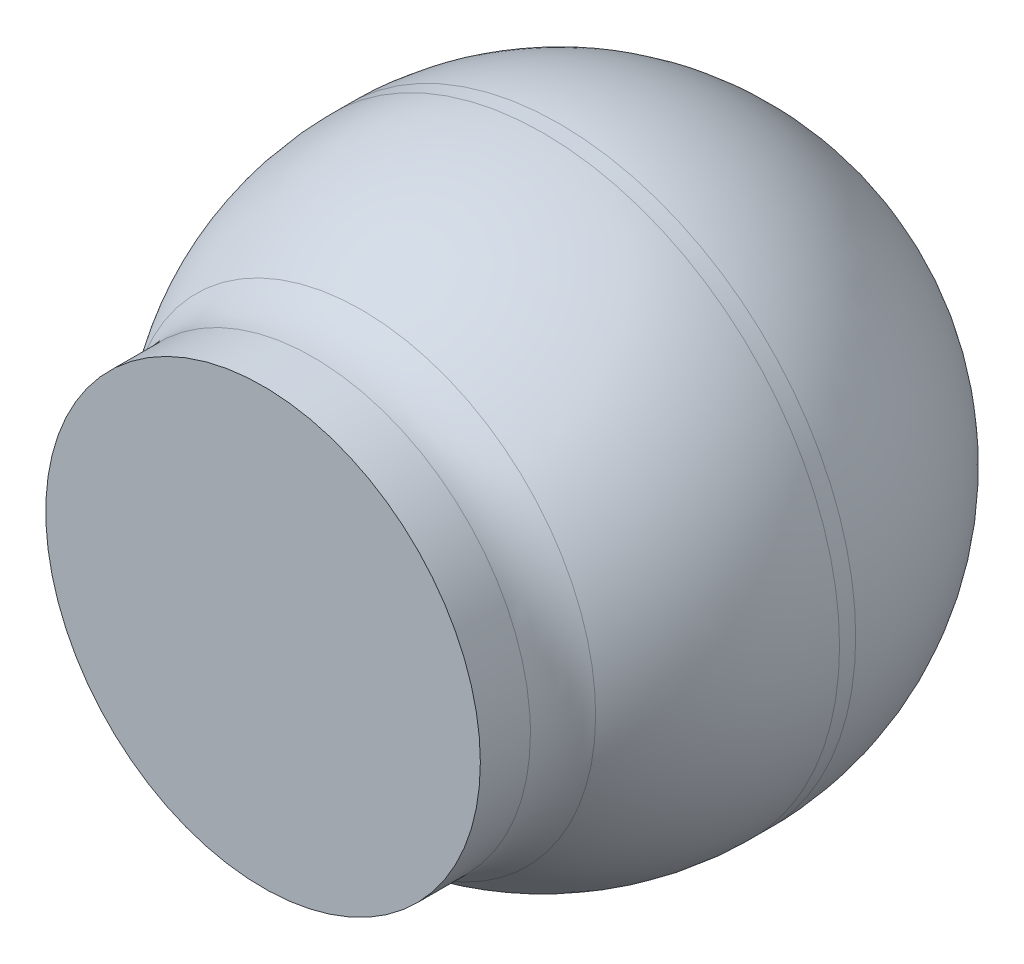
ISO-10303-21;
HEADER;
FILE_DESCRIPTION(('STEP AP214'),'2;1');
FILE_NAME('part.step','',(''),(''),'','','');
FILE_SCHEMA(('AUTOMOTIVE_DESIGN { 1 0 10303 214 1 1 1 1 }'));
ENDSEC;
DATA;
#1=APPLICATION_CONTEXT('core data for automotive mechanical design processes');
#2=APPLICATION_PROTOCOL_DEFINITION('international standard','automotive_design',2000,#1);
#3=PRODUCT_CONTEXT('',#1,'mechanical');
#4=PRODUCT('Part','Part','',(#3));
#5=PRODUCT_RELATED_PRODUCT_CATEGORY('part','',(#4));
#6=PRODUCT_DEFINITION_FORMATION('','',#4);
#7=PRODUCT_DEFINITION_CONTEXT('part definition',#1,'design');
#8=PRODUCT_DEFINITION('design','',#6,#7);
#9=PRODUCT_DEFINITION_SHAPE('','',#8);
#10=(LENGTH_UNIT() NAMED_UNIT(*) SI_UNIT(.MILLI.,.METRE.));
#11=(NAMED_UNIT(*) PLANE_ANGLE_UNIT() SI_UNIT($,.RADIAN.));
#12=(NAMED_UNIT(*) SI_UNIT($,.STERADIAN.) SOLID_ANGLE_UNIT());
#13=UNCERTAINTY_MEASURE_WITH_UNIT(LENGTH_MEASURE(1.E-05),#10,'distance_accuracy_value','');
#14=(GEOMETRIC_REPRESENTATION_CONTEXT(3) GLOBAL_UNCERTAINTY_ASSIGNED_CONTEXT((#13)) GLOBAL_UNIT_ASSIGNED_CONTEXT((#10,
#11,#12)) REPRESENTATION_CONTEXT('',''));
#15=CARTESIAN_POINT('',(0.,0.,0.));
#16=DIRECTION('',(0.,0.,1.));
#17=DIRECTION('',(1.,0.,0.));
#18=AXIS2_PLACEMENT_3D('',#15,#16,#17);
#19=CARTESIAN_POINT('',(-5.642919922269,-4.051349291452,10.006534503384));
#20=DIRECTION('',(0.,0.,-1.));
#21=DIRECTION('',(-1.,0.,0.));
#22=AXIS2_PLACEMENT_3D('',#19,#20,#21);
#23=PLANE('',#22);
#24=CARTESIAN_POINT('',(-5.642919922269,-4.051349291452,10.006534503384));
#25=DIRECTION('',(0.,0.,1.));
#26=DIRECTION('',(1.,0.,0.));
#27=AXIS2_PLACEMENT_3D('',#24,#25,#26);
#28=CIRCLE('',#27,0.275);
#29=CARTESIAN_POINT('',(-5.367919922269,-4.051349291452,10.006534503384));
#30=VERTEX_POINT('',#29);
#31=EDGE_CURVE('E20',#30,#30,#28,.F.);
#32=ORIENTED_EDGE('',*,*,#31,.F.);
#33=EDGE_LOOP('',(#32));
#34=FACE_BOUND('',#33,.T.);
#35=ADVANCED_FACE('F17',(#34),#23,.F.);
#36=CARTESIAN_POINT('',(-5.642919922269,-4.051349291452,9.906534503384));
#37=DIRECTION('',(0.,0.,1.));
#38=DIRECTION('',(1.,0.,0.));
#39=AXIS2_PLACEMENT_3D('',#36,#37,#38);
#40=CYLINDRICAL_SURFACE('',#39,0.275);
#41=CARTESIAN_POINT('',(-5.642919922269,-4.051349291452,9.943180457728));
#42=DIRECTION('',(0.,0.,-1.));
#43=DIRECTION('',(0.996700902337583,0.0811622527992439,0.));
#44=AXIS2_PLACEMENT_3D('',#41,#42,#43);
#45=CIRCLE('',#44,0.275);
#46=CARTESIAN_POINT('',(-5.36882717412616,-4.02902967193221,9.943180457728));
#47=VERTEX_POINT('',#46);
#48=EDGE_CURVE('E65',#47,#47,#45,.F.);
#49=ORIENTED_EDGE('',*,*,#48,.T.);
#50=EDGE_LOOP('',(#49));
#51=FACE_BOUND('',#50,.T.);
#52=ORIENTED_EDGE('',*,*,#31,.T.);
#53=EDGE_LOOP('',(#52));
#54=FACE_BOUND('',#53,.T.);
#55=ADVANCED_FACE('F62',(#51,#54),#40,.T.);
#56=CARTESIAN_POINT('',(-5.642919922269,-4.051349291452,9.943180457728));
#57=DIRECTION('',(0.,0.,-1.));
#58=DIRECTION('',(0.996700902337583,0.0811622527992448,0.));
#59=AXIS2_PLACEMENT_3D('',#56,#57,#58);
#60=TOROIDAL_SURFACE('',#59,0.375,0.1);
#61=ORIENTED_EDGE('',*,*,#48,.F.);
#62=EDGE_LOOP('',(#61));
#63=FACE_BOUND('',#62,.T.);
#64=CARTESIAN_POINT('',(-5.642919922269,-4.051349291452,9.881744931236));
#65=DIRECTION('',(0.,0.,-1.));
#66=DIRECTION('',(-0.996700902337598,-0.0811622527990591,0.));
#67=AXIS2_PLACEMENT_3D('',#64,#65,#66);
#68=CIRCLE('',#67,0.296097046412666);
#69=CARTESIAN_POINT('',(-5.938040115608,-4.075381194786,9.881744931236));
#70=VERTEX_POINT('',#69);
#71=EDGE_CURVE('E39',#70,#70,#68,.T.);
#72=ORIENTED_EDGE('',*,*,#71,.F.);
#73=EDGE_LOOP('',(#72));
#74=FACE_BOUND('',#73,.T.);
#75=ADVANCED_FACE('F57',(#63,#74),#60,.F.);
#76=CARTESIAN_POINT('',(-6.016682760645,-4.081785136252,9.651976062157));
#77=CARTESIAN_POINT('',(-6.016682760645,-4.081785136252,9.701461392103));
#78=CARTESIAN_POINT('',(-6.008526217348,-4.081120941579,9.750947004335));
#79=CARTESIAN_POINT('',(-5.992207085349,-4.079792059952,9.798626332798));
#80=CARTESIAN_POINT('',(-5.968341390838,-4.077848654938,9.842699544317));
#81=CARTESIAN_POINT('',(-5.938040115608,-4.075381194786,9.881744931236));
#82=(BOUNDED_CURVE() B_SPLINE_CURVE(5,(#76,#77,#78,#79,#80,#81),.UNSPECIFIED.,.F.,
.F.) B_SPLINE_CURVE_WITH_KNOTS((6,6),(0.,0.661568582165),
.UNSPECIFIED.) CURVE() GEOMETRIC_REPRESENTATION_ITEM() RATIONAL_B_SPLINE_CURVE((1.,1.,1.,1.,1.,1.)) REPRESENTATION_ITEM(''));
#83=CARTESIAN_POINT('',(-5.642919922269,-4.051349291452,9.651976062157));
#84=DIRECTION('',(0.,0.,-1.));
#85=AXIS1_PLACEMENT('',#83,#84);
#86=SURFACE_OF_REVOLUTION('',#82,#85);
#87=CARTESIAN_POINT('',(-5.642919922269,-4.051349291452,9.651976062157));
#88=DIRECTION('',(0.,0.,1.));
#89=DIRECTION('',(1.,0.,0.));
#90=AXIS2_PLACEMENT_3D('',#87,#88,#89);
#91=CIRCLE('',#90,0.375);
#92=CARTESIAN_POINT('',(-5.267919922269,-4.051349291452,9.651976062157));
#93=VERTEX_POINT('',#92);
#94=EDGE_CURVE('E36',#93,#93,#91,.F.);
#95=ORIENTED_EDGE('',*,*,#94,.F.);
#96=EDGE_LOOP('',(#95));
#97=FACE_BOUND('',#96,.T.);
#98=ORIENTED_EDGE('',*,*,#71,.T.);
#99=EDGE_LOOP('',(#98));
#100=FACE_BOUND('',#99,.T.);
#101=ADVANCED_FACE('F53',(#97,#100),#86,.F.);
#102=CARTESIAN_POINT('',(-5.642919922269,-4.051349291452,9.256534503384));
#103=DIRECTION('',(0.,0.,1.));
#104=DIRECTION('',(1.,0.,0.));
#105=AXIS2_PLACEMENT_3D('',#102,#103,#104);
#106=CYLINDRICAL_SURFACE('',#105,0.375);
#107=CARTESIAN_POINT('',(-5.642919922269,-4.051349291452,9.631534503384));
#108=DIRECTION('',(0.,0.,-1.));
#109=DIRECTION('',(0.0811622527992357,-0.996700902337583,0.));
#110=AXIS2_PLACEMENT_3D('',#107,#108,#109);
#111=CIRCLE('',#110,0.375);
#112=CARTESIAN_POINT('',(-5.61248407746929,-4.42511212982859,9.631534503384));
#113=VERTEX_POINT('',#112);
#114=CARTESIAN_POINT('',(-5.67335576706871,-3.67758645307541,9.631534503384));
#115=VERTEX_POINT('',#114);
#116=EDGE_CURVE('E11',#113,#115,#111,.T.);
#117=ORIENTED_EDGE('',*,*,#116,.F.);
#118=CARTESIAN_POINT('',(-5.642919922269,-4.051349291452,9.631534503384));
#119=DIRECTION('',(0.,0.,1.));
#120=DIRECTION('',(0.0811622527992365,-0.996700902337583,0.));
#121=AXIS2_PLACEMENT_3D('',#118,#119,#120);
#122=CIRCLE('',#121,0.375);
#123=EDGE_CURVE('E25',#115,#113,#122,.F.);
#124=ORIENTED_EDGE('',*,*,#123,.F.);
#125=EDGE_LOOP('',(#117,#124));
#126=FACE_BOUND('',#125,.T.);
#127=ORIENTED_EDGE('',*,*,#94,.T.);
#128=EDGE_LOOP('',(#127));
#129=FACE_BOUND('',#128,.T.);
#130=ADVANCED_FACE('F34',(#126,#129),#106,.T.);
#131=CARTESIAN_POINT('',(-5.642919922269,-4.051349291452,9.631534503384));
#132=DIRECTION('',(0.0811622527992361,-0.996700902337583,0.));
#133=DIRECTION('',(-0.996700902337583,-0.0811622527992361,0.));
#134=AXIS2_PLACEMENT_3D('',#131,#132,#133);
#135=SPHERICAL_SURFACE('',#134,0.375);
#136=ORIENTED_EDGE('',*,*,#123,.T.);
#137=ORIENTED_EDGE('',*,*,#116,.T.);
#138=EDGE_LOOP('',(#136,#137));
#139=FACE_BOUND('',#138,.T.);
#140=ADVANCED_FACE('F32',(#139),#135,.T.);
#141=CLOSED_SHELL('',(#35,#55,#75,#101,#130,#140));
#142=MANIFOLD_SOLID_BREP('B1',#141);
#143=ADVANCED_BREP_SHAPE_REPRESENTATION('',(#18,#142),#14);
#144=SHAPE_DEFINITION_REPRESENTATION(#9,#143);
ENDSEC;
END-ISO-10303-21;
